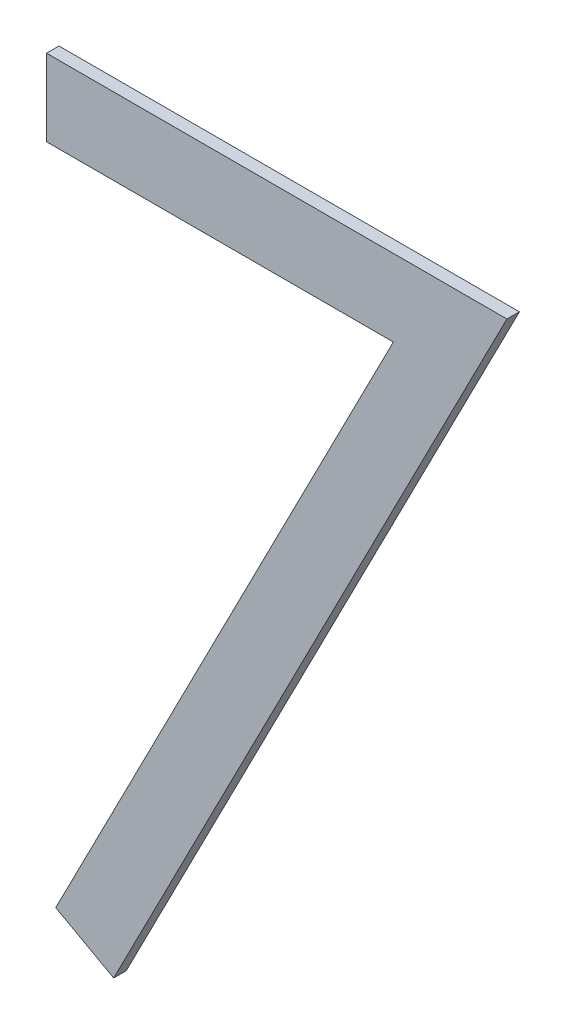
ISO-10303-21;
HEADER;
FILE_DESCRIPTION(('STEP AP214'),'2;1');
FILE_NAME('part.step','',(''),(''),'','','');
FILE_SCHEMA(('AUTOMOTIVE_DESIGN { 1 0 10303 214 1 1 1 1 }'));
ENDSEC;
DATA;
#1=APPLICATION_CONTEXT('core data for automotive mechanical design processes');
#2=APPLICATION_PROTOCOL_DEFINITION('international standard','automotive_design',2000,#1);
#3=PRODUCT_CONTEXT('',#1,'mechanical');
#4=PRODUCT('Part','Part','',(#3));
#5=PRODUCT_RELATED_PRODUCT_CATEGORY('part','',(#4));
#6=PRODUCT_DEFINITION_FORMATION('','',#4);
#7=PRODUCT_DEFINITION_CONTEXT('part definition',#1,'design');
#8=PRODUCT_DEFINITION('design','',#6,#7);
#9=PRODUCT_DEFINITION_SHAPE('','',#8);
#10=(LENGTH_UNIT() NAMED_UNIT(*) SI_UNIT(.MILLI.,.METRE.));
#11=(NAMED_UNIT(*) PLANE_ANGLE_UNIT() SI_UNIT($,.RADIAN.));
#12=(NAMED_UNIT(*) SI_UNIT($,.STERADIAN.) SOLID_ANGLE_UNIT());
#13=UNCERTAINTY_MEASURE_WITH_UNIT(LENGTH_MEASURE(1.E-05),#10,'distance_accuracy_value','');
#14=(GEOMETRIC_REPRESENTATION_CONTEXT(3) GLOBAL_UNCERTAINTY_ASSIGNED_CONTEXT((#13)) GLOBAL_UNIT_ASSIGNED_CONTEXT((#10,
#11,#12)) REPRESENTATION_CONTEXT('',''));
#15=CARTESIAN_POINT('',(0.,0.,0.));
#16=DIRECTION('',(0.,0.,1.));
#17=DIRECTION('',(1.,0.,0.));
#18=AXIS2_PLACEMENT_3D('',#15,#16,#17);
#19=CARTESIAN_POINT('',(0.470594749721532,1.06273011000654,0.551));
#20=DIRECTION('',(-1.,0.,0.));
#21=DIRECTION('',(0.,0.,1.));
#22=AXIS2_PLACEMENT_3D('',#19,#20,#21);
#23=PLANE('',#22);
#24=DIRECTION('',(0.,1.,0.));
#25=VECTOR('',#24,1.);
#26=CARTESIAN_POINT('',(0.470594749721532,1.06273011000654,0.55));
#27=LINE('',#26,#25);
#28=CARTESIAN_POINT('',(0.470594749721532,1.06273011000654,0.55));
#29=VERTEX_POINT('',#28);
#30=CARTESIAN_POINT('',(0.470594749721532,1.06888395616039,0.55));
#31=VERTEX_POINT('',#30);
#32=EDGE_CURVE('E11',#29,#31,#27,.T.);
#33=ORIENTED_EDGE('',*,*,#32,.F.);
#34=DIRECTION('',(0.,-2.22044604925006E-13,-1.));
#35=VECTOR('',#34,1.);
#36=CARTESIAN_POINT('',(0.470594749721532,1.06273011000654,0.551));
#37=LINE('',#36,#35);
#38=CARTESIAN_POINT('',(0.470594749721532,1.06273011000654,0.551));
#39=VERTEX_POINT('',#38);
#40=EDGE_CURVE('E119',#39,#29,#37,.T.);
#41=ORIENTED_EDGE('',*,*,#40,.F.);
#42=DIRECTION('',(0.,1.,0.));
#43=VECTOR('',#42,1.);
#44=CARTESIAN_POINT('',(0.470594749721532,1.06273011000654,0.551));
#45=LINE('',#44,#43);
#46=CARTESIAN_POINT('',(0.470594749721532,1.06888395616039,0.551));
#47=VERTEX_POINT('',#46);
#48=EDGE_CURVE('E112',#39,#47,#45,.T.);
#49=ORIENTED_EDGE('',*,*,#48,.T.);
#50=DIRECTION('',(0.,0.,-1.));
#51=VECTOR('',#50,1.);
#52=CARTESIAN_POINT('',(0.470594749721532,1.06888395616039,0.551));
#53=LINE('',#52,#51);
#54=EDGE_CURVE('E85',#47,#31,#53,.T.);
#55=ORIENTED_EDGE('',*,*,#54,.T.);
#56=EDGE_LOOP('',(#33,#41,#49,#55));
#57=FACE_BOUND('',#56,.T.);
#58=ADVANCED_FACE('F17',(#57),#23,.T.);
#59=CARTESIAN_POINT('',(0.498407249721532,1.06273011000654,0.551));
#60=DIRECTION('',(0.,-1.,0.));
#61=DIRECTION('',(0.,0.,-1.));
#62=AXIS2_PLACEMENT_3D('',#59,#60,#61);
#63=PLANE('',#62);
#64=DIRECTION('',(-1.,0.,0.));
#65=VECTOR('',#64,1.);
#66=CARTESIAN_POINT('',(0.498407249721532,1.06273011000654,0.55));
#67=LINE('',#66,#65);
#68=CARTESIAN_POINT('',(0.498407249721532,1.06273011000654,0.55));
#69=VERTEX_POINT('',#68);
#70=EDGE_CURVE('E24',#69,#29,#67,.T.);
#71=ORIENTED_EDGE('',*,*,#70,.F.);
#72=DIRECTION('',(0.,-2.22044604925006E-13,-1.));
#73=VECTOR('',#72,1.);
#74=CARTESIAN_POINT('',(0.498407249721532,1.06273011000654,0.551));
#75=LINE('',#74,#73);
#76=CARTESIAN_POINT('',(0.498407249721532,1.06273011000654,0.551));
#77=VERTEX_POINT('',#76);
#78=EDGE_CURVE('E114',#77,#69,#75,.T.);
#79=ORIENTED_EDGE('',*,*,#78,.F.);
#80=DIRECTION('',(-1.,0.,0.));
#81=VECTOR('',#80,1.);
#82=CARTESIAN_POINT('',(0.498407249721532,1.06273011000654,0.551));
#83=LINE('',#82,#81);
#84=EDGE_CURVE('E103',#77,#39,#83,.T.);
#85=ORIENTED_EDGE('',*,*,#84,.T.);
#86=ORIENTED_EDGE('',*,*,#40,.T.);
#87=EDGE_LOOP('',(#71,#79,#85,#86));
#88=FACE_BOUND('',#87,.T.);
#89=ADVANCED_FACE('F127',(#88),#63,.T.);
#90=CARTESIAN_POINT('',(0.471327922798455,1.00990559077577,0.551));
#91=DIRECTION('',(-0.889887017756643,0.456180989989925,0.));
#92=DIRECTION('',(-0.456180989989925,-0.889887017756643,0.));
#93=AXIS2_PLACEMENT_3D('',#90,#91,#92);
#94=PLANE('',#93);
#95=DIRECTION('',(0.456180989989925,0.889887017756643,0.));
#96=VECTOR('',#95,1.);
#97=CARTESIAN_POINT('',(0.471327922798455,1.00990559077577,0.55));
#98=LINE('',#97,#96);
#99=CARTESIAN_POINT('',(0.471327922798455,1.00990559077577,0.55));
#100=VERTEX_POINT('',#99);
#101=EDGE_CURVE('E116',#100,#69,#98,.T.);
#102=ORIENTED_EDGE('',*,*,#101,.F.);
#103=DIRECTION('',(0.,0.,-1.));
#104=VECTOR('',#103,1.);
#105=CARTESIAN_POINT('',(0.471327922798455,1.00990559077577,0.551));
#106=LINE('',#105,#104);
#107=CARTESIAN_POINT('',(0.471327922798455,1.00990559077577,0.551));
#108=VERTEX_POINT('',#107);
#109=EDGE_CURVE('E106',#108,#100,#106,.T.);
#110=ORIENTED_EDGE('',*,*,#109,.F.);
#111=DIRECTION('',(0.456180989989925,0.889887017756643,0.));
#112=VECTOR('',#111,1.);
#113=CARTESIAN_POINT('',(0.471327922798455,1.00990559077577,0.551));
#114=LINE('',#113,#112);
#115=EDGE_CURVE('E96',#108,#77,#114,.T.);
#116=ORIENTED_EDGE('',*,*,#115,.T.);
#117=ORIENTED_EDGE('',*,*,#78,.T.);
#118=EDGE_LOOP('',(#102,#110,#116,#117));
#119=FACE_BOUND('',#118,.T.);
#120=ADVANCED_FACE('F123',(#119),#94,.T.);
#121=CARTESIAN_POINT('',(0.475979365106147,1.00734549462193,0.551));
#122=DIRECTION('',(-0.482179429384513,-0.876072484374681,0.));
#123=DIRECTION('',(0.876072484374681,-0.482179429384513,0.));
#124=AXIS2_PLACEMENT_3D('',#121,#122,#123);
#125=PLANE('',#124);
#126=DIRECTION('',(-0.876072484374679,0.482179429384516,0.));
#127=VECTOR('',#126,1.);
#128=CARTESIAN_POINT('',(0.475979365106147,1.00734549462193,0.55));
#129=LINE('',#128,#127);
#130=CARTESIAN_POINT('',(0.475979365106147,1.00734549462193,0.55));
#131=VERTEX_POINT('',#130);
#132=EDGE_CURVE('E109',#131,#100,#129,.T.);
#133=ORIENTED_EDGE('',*,*,#132,.F.);
#134=DIRECTION('',(0.,0.,-1.));
#135=VECTOR('',#134,1.);
#136=CARTESIAN_POINT('',(0.475979365106147,1.00734549462193,0.551));
#137=LINE('',#136,#135);
#138=CARTESIAN_POINT('',(0.475979365106147,1.00734549462193,0.551));
#139=VERTEX_POINT('',#138);
#140=EDGE_CURVE('E99',#139,#131,#137,.T.);
#141=ORIENTED_EDGE('',*,*,#140,.F.);
#142=DIRECTION('',(-0.876072484374679,0.482179429384516,0.));
#143=VECTOR('',#142,1.);
#144=CARTESIAN_POINT('',(0.475979365106147,1.00734549462193,0.551));
#145=LINE('',#144,#143);
#146=EDGE_CURVE('E79',#139,#108,#145,.T.);
#147=ORIENTED_EDGE('',*,*,#146,.T.);
#148=ORIENTED_EDGE('',*,*,#109,.T.);
#149=EDGE_LOOP('',(#133,#141,#147,#148));
#150=FACE_BOUND('',#149,.T.);
#151=ADVANCED_FACE('F125',(#150),#125,.T.);
#152=CARTESIAN_POINT('',(0.507517826644609,1.06888395616039,0.551));
#153=DIRECTION('',(0.889933250556875,-0.4560907909104,0.));
#154=DIRECTION('',(0.4560907909104,0.889933250556875,0.));
#155=AXIS2_PLACEMENT_3D('',#152,#153,#154);
#156=PLANE('',#155);
#157=DIRECTION('',(-0.4560907909104,-0.889933250556875,0.));
#158=VECTOR('',#157,1.);
#159=CARTESIAN_POINT('',(0.507517826644609,1.06888395616039,0.55));
#160=LINE('',#159,#158);
#161=CARTESIAN_POINT('',(0.507517826644609,1.06888395616039,0.55));
#162=VERTEX_POINT('',#161);
#163=EDGE_CURVE('E74',#162,#131,#160,.T.);
#164=ORIENTED_EDGE('',*,*,#163,.F.);
#165=DIRECTION('',(0.,0.,-1.));
#166=VECTOR('',#165,1.);
#167=CARTESIAN_POINT('',(0.507517826644609,1.06888395616039,0.551));
#168=LINE('',#167,#166);
#169=CARTESIAN_POINT('',(0.507517826644609,1.06888395616039,0.551));
#170=VERTEX_POINT('',#169);
#171=EDGE_CURVE('E66',#170,#162,#168,.T.);
#172=ORIENTED_EDGE('',*,*,#171,.F.);
#173=DIRECTION('',(-0.4560907909104,-0.889933250556875,0.));
#174=VECTOR('',#173,1.);
#175=CARTESIAN_POINT('',(0.507517826644609,1.06888395616039,0.551));
#176=LINE('',#175,#174);
#177=EDGE_CURVE('E71',#170,#139,#176,.T.);
#178=ORIENTED_EDGE('',*,*,#177,.T.);
#179=ORIENTED_EDGE('',*,*,#140,.T.);
#180=EDGE_LOOP('',(#164,#172,#178,#179));
#181=FACE_BOUND('',#180,.T.);
#182=ADVANCED_FACE('F68',(#181),#156,.T.);
#183=CARTESIAN_POINT('',(0.470594749721532,1.06888395616039,0.551));
#184=DIRECTION('',(0.,1.,0.));
#185=DIRECTION('',(0.,0.,1.));
#186=AXIS2_PLACEMENT_3D('',#183,#184,#185);
#187=PLANE('',#186);
#188=DIRECTION('',(1.,0.,0.));
#189=VECTOR('',#188,1.);
#190=CARTESIAN_POINT('',(0.470594749721532,1.06888395616039,0.55));
#191=LINE('',#190,#189);
#192=EDGE_CURVE('E78',#31,#162,#191,.T.);
#193=ORIENTED_EDGE('',*,*,#192,.F.);
#194=ORIENTED_EDGE('',*,*,#54,.F.);
#195=DIRECTION('',(1.,0.,0.));
#196=VECTOR('',#195,1.);
#197=CARTESIAN_POINT('',(0.470594749721532,1.06888395616039,0.551));
#198=LINE('',#197,#196);
#199=EDGE_CURVE('E83',#47,#170,#198,.T.);
#200=ORIENTED_EDGE('',*,*,#199,.T.);
#201=ORIENTED_EDGE('',*,*,#171,.T.);
#202=EDGE_LOOP('',(#193,#194,#200,#201));
#203=FACE_BOUND('',#202,.T.);
#204=ADVANCED_FACE('F84',(#203),#187,.T.);
#205=CARTESIAN_POINT('',(0.,0.,0.551));
#206=DIRECTION('',(0.,0.,-1.));
#207=DIRECTION('',(-1.,0.,0.));
#208=AXIS2_PLACEMENT_3D('',#205,#206,#207);
#209=PLANE('',#208);
#210=ORIENTED_EDGE('',*,*,#48,.F.);
#211=ORIENTED_EDGE('',*,*,#84,.F.);
#212=ORIENTED_EDGE('',*,*,#115,.F.);
#213=ORIENTED_EDGE('',*,*,#146,.F.);
#214=ORIENTED_EDGE('',*,*,#177,.F.);
#215=ORIENTED_EDGE('',*,*,#199,.F.);
#216=EDGE_LOOP('',(#210,#211,#212,#213,#214,#215));
#217=FACE_BOUND('',#216,.T.);
#218=ADVANCED_FACE('F89',(#217),#209,.F.);
#219=CARTESIAN_POINT('',(0.,0.,0.55));
#220=DIRECTION('',(0.,0.,-1.));
#221=DIRECTION('',(-1.,0.,0.));
#222=AXIS2_PLACEMENT_3D('',#219,#220,#221);
#223=PLANE('',#222);
#224=ORIENTED_EDGE('',*,*,#32,.T.);
#225=ORIENTED_EDGE('',*,*,#192,.T.);
#226=ORIENTED_EDGE('',*,*,#163,.T.);
#227=ORIENTED_EDGE('',*,*,#132,.T.);
#228=ORIENTED_EDGE('',*,*,#101,.T.);
#229=ORIENTED_EDGE('',*,*,#70,.T.);
#230=EDGE_LOOP('',(#224,#225,#226,#227,#228,#229));
#231=FACE_BOUND('',#230,.T.);
#232=ADVANCED_FACE('F121',(#231),#223,.T.);
#233=CLOSED_SHELL('',(#58,#89,#120,#151,#182,#204,#218,#232));
#234=MANIFOLD_SOLID_BREP('B1',#233);
#235=ADVANCED_BREP_SHAPE_REPRESENTATION('',(#18,#234),#14);
#236=SHAPE_DEFINITION_REPRESENTATION(#9,#235);
ENDSEC;
END-ISO-10303-21;
